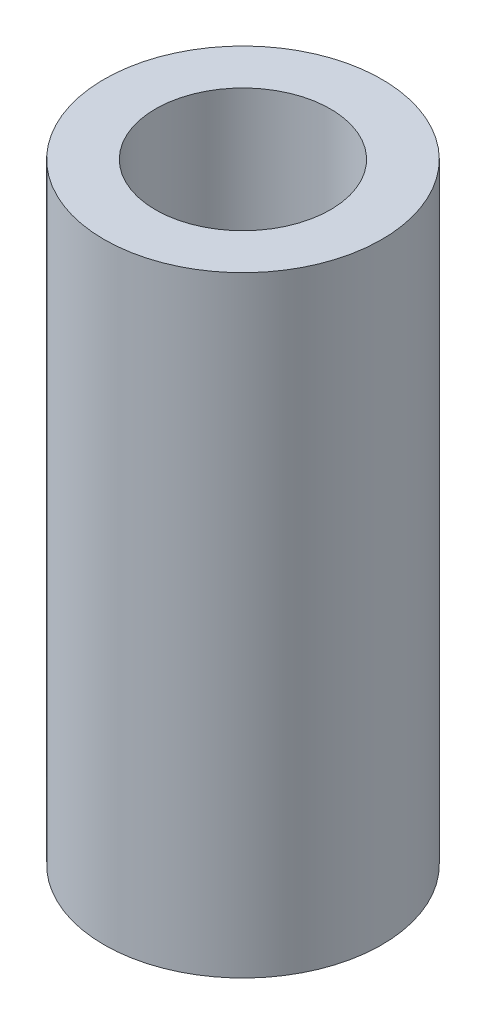
ISO-10303-21;
HEADER;
FILE_DESCRIPTION(('STEP AP214'),'2;1');
FILE_NAME('part.step','',(''),(''),'','','');
FILE_SCHEMA(('AUTOMOTIVE_DESIGN { 1 0 10303 214 1 1 1 1 }'));
ENDSEC;
DATA;
#1=APPLICATION_CONTEXT('core data for automotive mechanical design processes');
#2=APPLICATION_PROTOCOL_DEFINITION('international standard','automotive_design',2000,#1);
#3=PRODUCT_CONTEXT('',#1,'mechanical');
#4=PRODUCT('Part','Part','',(#3));
#5=PRODUCT_RELATED_PRODUCT_CATEGORY('part','',(#4));
#6=PRODUCT_DEFINITION_FORMATION('','',#4);
#7=PRODUCT_DEFINITION_CONTEXT('part definition',#1,'design');
#8=PRODUCT_DEFINITION('design','',#6,#7);
#9=PRODUCT_DEFINITION_SHAPE('','',#8);
#10=(LENGTH_UNIT() NAMED_UNIT(*) SI_UNIT(.MILLI.,.METRE.));
#11=(NAMED_UNIT(*) PLANE_ANGLE_UNIT() SI_UNIT($,.RADIAN.));
#12=(NAMED_UNIT(*) SI_UNIT($,.STERADIAN.) SOLID_ANGLE_UNIT());
#13=UNCERTAINTY_MEASURE_WITH_UNIT(LENGTH_MEASURE(1.E-05),#10,'distance_accuracy_value','');
#14=(GEOMETRIC_REPRESENTATION_CONTEXT(3) GLOBAL_UNCERTAINTY_ASSIGNED_CONTEXT((#13)) GLOBAL_UNIT_ASSIGNED_CONTEXT((#10,
#11,#12)) REPRESENTATION_CONTEXT('',''));
#15=CARTESIAN_POINT('',(0.,0.,0.));
#16=DIRECTION('',(0.,0.,1.));
#17=DIRECTION('',(1.,0.,0.));
#18=AXIS2_PLACEMENT_3D('',#15,#16,#17);
#19=CARTESIAN_POINT('',(0.,-13.97,0.));
#20=DIRECTION('',(0.,1.,0.));
#21=DIRECTION('',(0.,0.,1.));
#22=AXIS2_PLACEMENT_3D('',#19,#20,#21);
#23=CYLINDRICAL_SURFACE('',#22,3.175);
#24=CARTESIAN_POINT('',(0.,-13.97,0.));
#25=DIRECTION('',(0.,1.,0.));
#26=DIRECTION('',(0.,0.,1.));
#27=AXIS2_PLACEMENT_3D('',#24,#25,#26);
#28=CIRCLE('',#27,3.175);
#29=CARTESIAN_POINT('',(0.,-13.97,3.175));
#30=VERTEX_POINT('',#29);
#31=EDGE_CURVE('E10',#30,#30,#28,.T.);
#32=ORIENTED_EDGE('',*,*,#31,.T.);
#33=EDGE_LOOP('',(#32));
#34=FACE_BOUND('',#33,.T.);
#35=CARTESIAN_POINT('',(0.,0.,0.));
#36=DIRECTION('',(0.,1.,0.));
#37=DIRECTION('',(0.,0.,1.));
#38=AXIS2_PLACEMENT_3D('',#35,#36,#37);
#39=CIRCLE('',#38,3.175);
#40=CARTESIAN_POINT('',(0.,0.,3.175));
#41=VERTEX_POINT('',#40);
#42=EDGE_CURVE('E40',#41,#41,#39,.T.);
#43=ORIENTED_EDGE('',*,*,#42,.F.);
#44=EDGE_LOOP('',(#43));
#45=FACE_BOUND('',#44,.T.);
#46=ADVANCED_FACE('F37',(#34,#45),#23,.T.);
#47=CARTESIAN_POINT('',(0.,-13.97,0.));
#48=DIRECTION('',(0.,1.,0.));
#49=DIRECTION('',(0.,0.,1.));
#50=AXIS2_PLACEMENT_3D('',#47,#48,#49);
#51=PLANE('',#50);
#52=CARTESIAN_POINT('',(0.,-13.97,0.));
#53=DIRECTION('',(0.,1.,0.));
#54=DIRECTION('',(0.,0.,1.));
#55=AXIS2_PLACEMENT_3D('',#52,#53,#54);
#56=CIRCLE('',#55,1.999996);
#57=CARTESIAN_POINT('',(0.,-13.97,1.999996));
#58=VERTEX_POINT('',#57);
#59=EDGE_CURVE('E49',#58,#58,#56,.T.);
#60=ORIENTED_EDGE('',*,*,#59,.T.);
#61=EDGE_LOOP('',(#60));
#62=FACE_BOUND('',#61,.T.);
#63=ORIENTED_EDGE('',*,*,#31,.F.);
#64=EDGE_LOOP('',(#63));
#65=FACE_BOUND('',#64,.T.);
#66=ADVANCED_FACE('F59',(#62,#65),#51,.F.);
#67=CARTESIAN_POINT('',(0.,0.,0.));
#68=DIRECTION('',(0.,1.,0.));
#69=DIRECTION('',(0.,0.,1.));
#70=AXIS2_PLACEMENT_3D('',#67,#68,#69);
#71=PLANE('',#70);
#72=CARTESIAN_POINT('',(0.,0.,0.));
#73=DIRECTION('',(0.,1.,0.));
#74=DIRECTION('',(0.,0.,1.));
#75=AXIS2_PLACEMENT_3D('',#72,#73,#74);
#76=CIRCLE('',#75,1.999996);
#77=CARTESIAN_POINT('',(0.,0.,1.999996));
#78=VERTEX_POINT('',#77);
#79=EDGE_CURVE('E51',#78,#78,#76,.T.);
#80=ORIENTED_EDGE('',*,*,#79,.F.);
#81=EDGE_LOOP('',(#80));
#82=FACE_BOUND('',#81,.T.);
#83=ORIENTED_EDGE('',*,*,#42,.T.);
#84=EDGE_LOOP('',(#83));
#85=FACE_BOUND('',#84,.T.);
#86=ADVANCED_FACE('F65',(#82,#85),#71,.T.);
#87=CARTESIAN_POINT('',(0.,-13.97,0.));
#88=DIRECTION('',(0.,1.,0.));
#89=DIRECTION('',(0.,0.,1.));
#90=AXIS2_PLACEMENT_3D('',#87,#88,#89);
#91=CYLINDRICAL_SURFACE('',#90,1.999996);
#92=ORIENTED_EDGE('',*,*,#59,.F.);
#93=EDGE_LOOP('',(#92));
#94=FACE_BOUND('',#93,.T.);
#95=ORIENTED_EDGE('',*,*,#79,.T.);
#96=EDGE_LOOP('',(#95));
#97=FACE_BOUND('',#96,.T.);
#98=ADVANCED_FACE('F62',(#94,#97),#91,.F.);
#99=CLOSED_SHELL('',(#46,#66,#86,#98));
#100=MANIFOLD_SOLID_BREP('B2',#99);
#101=ADVANCED_BREP_SHAPE_REPRESENTATION('',(#18,#100),#14);
#102=SHAPE_DEFINITION_REPRESENTATION(#9,#101);
ENDSEC;
END-ISO-10303-21;
